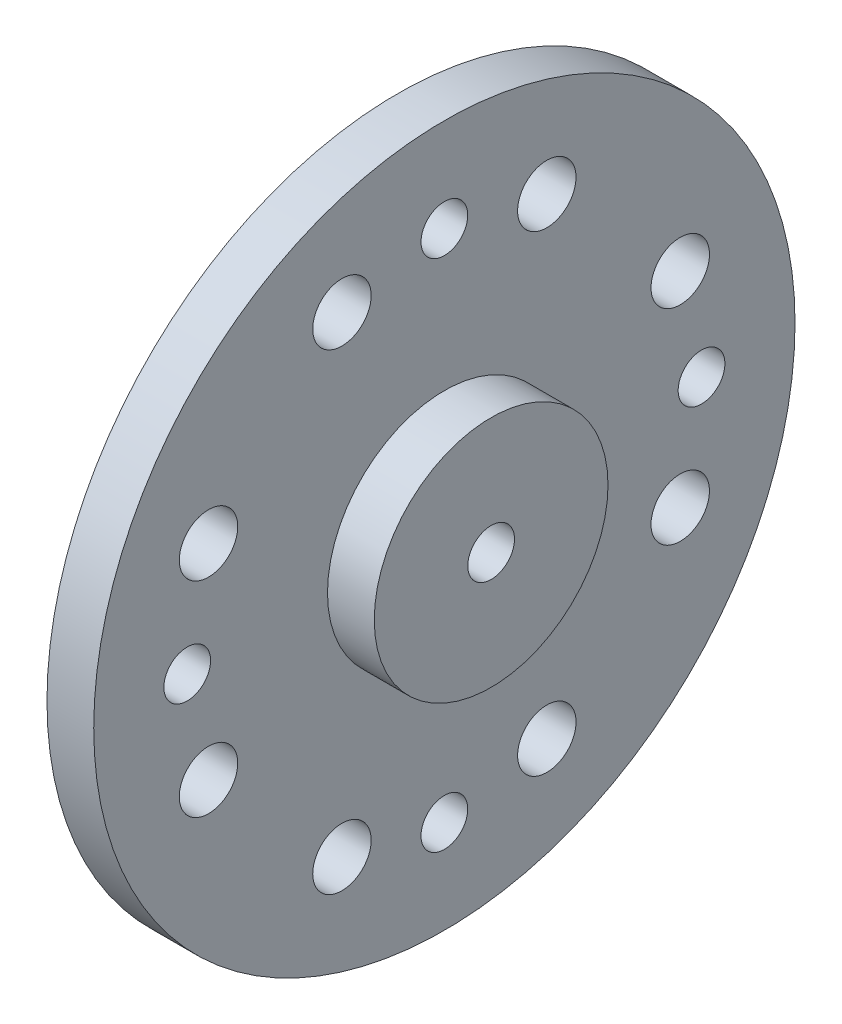
ISO-10303-21;
HEADER;
FILE_DESCRIPTION(('STEP AP214'),'2;1');
FILE_NAME('part.step','',(''),(''),'','','');
FILE_SCHEMA(('AUTOMOTIVE_DESIGN { 1 0 10303 214 1 1 1 1 }'));
ENDSEC;
DATA;
#1=APPLICATION_CONTEXT('core data for automotive mechanical design processes');
#2=APPLICATION_PROTOCOL_DEFINITION('international standard','automotive_design',2000,#1);
#3=PRODUCT_CONTEXT('',#1,'mechanical');
#4=PRODUCT('Part','Part','',(#3));
#5=PRODUCT_RELATED_PRODUCT_CATEGORY('part','',(#4));
#6=PRODUCT_DEFINITION_FORMATION('','',#4);
#7=PRODUCT_DEFINITION_CONTEXT('part definition',#1,'design');
#8=PRODUCT_DEFINITION('design','',#6,#7);
#9=PRODUCT_DEFINITION_SHAPE('','',#8);
#10=(LENGTH_UNIT() NAMED_UNIT(*) SI_UNIT(.MILLI.,.METRE.));
#11=(NAMED_UNIT(*) PLANE_ANGLE_UNIT() SI_UNIT($,.RADIAN.));
#12=(NAMED_UNIT(*) SI_UNIT($,.STERADIAN.) SOLID_ANGLE_UNIT());
#13=UNCERTAINTY_MEASURE_WITH_UNIT(LENGTH_MEASURE(1.E-05),#10,'distance_accuracy_value','');
#14=(GEOMETRIC_REPRESENTATION_CONTEXT(3) GLOBAL_UNCERTAINTY_ASSIGNED_CONTEXT((#13)) GLOBAL_UNIT_ASSIGNED_CONTEXT((#10,
#11,#12)) REPRESENTATION_CONTEXT('',''));
#15=CARTESIAN_POINT('',(0.,0.,0.));
#16=DIRECTION('',(0.,0.,1.));
#17=DIRECTION('',(1.,0.,0.));
#18=AXIS2_PLACEMENT_3D('',#15,#16,#17);
#19=CARTESIAN_POINT('',(0.,0.,0.));
#20=DIRECTION('',(-1.,0.,0.));
#21=DIRECTION('',(0.,0.,1.));
#22=AXIS2_PLACEMENT_3D('',#19,#20,#21);
#23=CYLINDRICAL_SURFACE('',#22,15.);
#24=CARTESIAN_POINT('',(3.,0.,0.));
#25=DIRECTION('',(-1.,0.,0.));
#26=DIRECTION('',(0.,0.,1.));
#27=AXIS2_PLACEMENT_3D('',#24,#25,#26);
#28=CIRCLE('',#27,15.);
#29=CARTESIAN_POINT('',(3.,0.,15.));
#30=VERTEX_POINT('',#29);
#31=EDGE_CURVE('E39',#30,#30,#28,.T.);
#32=ORIENTED_EDGE('',*,*,#31,.T.);
#33=EDGE_LOOP('',(#32));
#34=FACE_BOUND('',#33,.T.);
#35=CARTESIAN_POINT('',(1.,0.,0.));
#36=DIRECTION('',(-1.,0.,0.));
#37=DIRECTION('',(0.,0.,1.));
#38=AXIS2_PLACEMENT_3D('',#35,#36,#37);
#39=CIRCLE('',#38,15.);
#40=CARTESIAN_POINT('',(1.,0.,15.));
#41=VERTEX_POINT('',#40);
#42=EDGE_CURVE('E129',#41,#41,#39,.T.);
#43=ORIENTED_EDGE('',*,*,#42,.F.);
#44=EDGE_LOOP('',(#43));
#45=FACE_BOUND('',#44,.T.);
#46=ADVANCED_FACE('F31',(#34,#45),#23,.T.);
#47=CARTESIAN_POINT('',(0.,15.,0.));
#48=DIRECTION('',(1.,0.,0.));
#49=DIRECTION('',(0.,0.,-1.));
#50=AXIS2_PLACEMENT_3D('',#47,#48,#49);
#51=PLANE('',#50);
#52=CARTESIAN_POINT('',(0.,0.,0.));
#53=DIRECTION('',(1.,0.,0.));
#54=DIRECTION('',(0.,0.,-1.));
#55=AXIS2_PLACEMENT_3D('',#52,#53,#54);
#56=CIRCLE('',#55,1.5);
#57=CARTESIAN_POINT('',(0.,0.,-1.5));
#58=VERTEX_POINT('',#57);
#59=EDGE_CURVE('E43',#58,#58,#56,.T.);
#60=ORIENTED_EDGE('',*,*,#59,.T.);
#61=EDGE_LOOP('',(#60));
#62=FACE_BOUND('',#61,.T.);
#63=CARTESIAN_POINT('',(0.,0.,0.));
#64=DIRECTION('',(-1.,0.,0.));
#65=DIRECTION('',(0.,0.,1.));
#66=AXIS2_PLACEMENT_3D('',#63,#64,#65);
#67=CIRCLE('',#66,5.);
#68=CARTESIAN_POINT('',(0.,0.,5.));
#69=VERTEX_POINT('',#68);
#70=EDGE_CURVE('E133',#69,#69,#67,.T.);
#71=ORIENTED_EDGE('',*,*,#70,.T.);
#72=EDGE_LOOP('',(#71));
#73=FACE_BOUND('',#72,.T.);
#74=ADVANCED_FACE('F165',(#62,#73),#51,.F.);
#75=CARTESIAN_POINT('',(0.,11.,0.));
#76=DIRECTION('',(1.,0.,0.));
#77=DIRECTION('',(0.,0.,-1.));
#78=AXIS2_PLACEMENT_3D('',#75,#76,#77);
#79=CYLINDRICAL_SURFACE('',#78,1.);
#80=CARTESIAN_POINT('',(3.,11.,0.));
#81=DIRECTION('',(1.,0.,0.));
#82=DIRECTION('',(0.,0.,-1.));
#83=AXIS2_PLACEMENT_3D('',#80,#81,#82);
#84=CIRCLE('',#83,1.);
#85=CARTESIAN_POINT('',(3.,11.,-1.));
#86=VERTEX_POINT('',#85);
#87=EDGE_CURVE('E48',#86,#86,#84,.T.);
#88=ORIENTED_EDGE('',*,*,#87,.T.);
#89=EDGE_LOOP('',(#88));
#90=FACE_BOUND('',#89,.T.);
#91=CARTESIAN_POINT('',(1.,11.,0.));
#92=DIRECTION('',(-1.,0.,0.));
#93=DIRECTION('',(0.,0.,1.));
#94=AXIS2_PLACEMENT_3D('',#91,#92,#93);
#95=CIRCLE('',#94,1.);
#96=CARTESIAN_POINT('',(1.,11.,1.));
#97=VERTEX_POINT('',#96);
#98=EDGE_CURVE('E94',#97,#97,#95,.F.);
#99=ORIENTED_EDGE('',*,*,#98,.F.);
#100=EDGE_LOOP('',(#99));
#101=FACE_BOUND('',#100,.T.);
#102=ADVANCED_FACE('F162',(#90,#101),#79,.F.);
#103=CARTESIAN_POINT('',(0.,10.089572098093,4.38184149386807));
#104=DIRECTION('',(1.,0.,0.));
#105=DIRECTION('',(0.,0.,-1.));
#106=AXIS2_PLACEMENT_3D('',#103,#104,#105);
#107=CYLINDRICAL_SURFACE('',#106,1.25);
#108=CARTESIAN_POINT('',(3.,10.089572098093,4.38184149386807));
#109=DIRECTION('',(1.,0.,0.));
#110=DIRECTION('',(0.,0.,-1.));
#111=AXIS2_PLACEMENT_3D('',#108,#109,#110);
#112=CIRCLE('',#111,1.25);
#113=CARTESIAN_POINT('',(3.,10.089572098093,3.13184149386807));
#114=VERTEX_POINT('',#113);
#115=EDGE_CURVE('E51',#114,#114,#112,.T.);
#116=ORIENTED_EDGE('',*,*,#115,.T.);
#117=EDGE_LOOP('',(#116));
#118=FACE_BOUND('',#117,.T.);
#119=CARTESIAN_POINT('',(1.,10.089572098093,4.38184149386807));
#120=DIRECTION('',(-1.,0.,0.));
#121=DIRECTION('',(0.,0.,1.));
#122=AXIS2_PLACEMENT_3D('',#119,#120,#121);
#123=CIRCLE('',#122,1.25);
#124=CARTESIAN_POINT('',(1.,10.089572098093,5.63184149386807));
#125=VERTEX_POINT('',#124);
#126=EDGE_CURVE('E99',#125,#125,#123,.F.);
#127=ORIENTED_EDGE('',*,*,#126,.F.);
#128=EDGE_LOOP('',(#127));
#129=FACE_BOUND('',#128,.T.);
#130=ADVANCED_FACE('F164',(#118,#129),#107,.F.);
#131=CARTESIAN_POINT('',(0.,10.0895720980929,-4.38184149386807));
#132=DIRECTION('',(1.,0.,0.));
#133=DIRECTION('',(0.,0.,-1.));
#134=AXIS2_PLACEMENT_3D('',#131,#132,#133);
#135=CYLINDRICAL_SURFACE('',#134,1.25);
#136=CARTESIAN_POINT('',(3.,10.0895720980929,-4.38184149386807));
#137=DIRECTION('',(1.,0.,0.));
#138=DIRECTION('',(0.,0.,1.));
#139=AXIS2_PLACEMENT_3D('',#136,#137,#138);
#140=CIRCLE('',#139,1.25);
#141=CARTESIAN_POINT('',(3.,10.0895720980929,-3.13184149386807));
#142=VERTEX_POINT('',#141);
#143=EDGE_CURVE('E54',#142,#142,#140,.T.);
#144=ORIENTED_EDGE('',*,*,#143,.T.);
#145=EDGE_LOOP('',(#144));
#146=FACE_BOUND('',#145,.T.);
#147=CARTESIAN_POINT('',(1.,10.0895720980929,-4.38184149386807));
#148=DIRECTION('',(-1.,0.,0.));
#149=DIRECTION('',(0.,0.,1.));
#150=AXIS2_PLACEMENT_3D('',#147,#148,#149);
#151=CIRCLE('',#150,1.25);
#152=CARTESIAN_POINT('',(1.,10.0895720980929,-3.13184149386807));
#153=VERTEX_POINT('',#152);
#154=EDGE_CURVE('E102',#153,#153,#151,.F.);
#155=ORIENTED_EDGE('',*,*,#154,.F.);
#156=EDGE_LOOP('',(#155));
#157=FACE_BOUND('',#156,.T.);
#158=ADVANCED_FACE('F172',(#146,#157),#135,.F.);
#159=CARTESIAN_POINT('',(0.,0.,-11.));
#160=DIRECTION('',(1.,0.,0.));
#161=DIRECTION('',(0.,0.,-1.));
#162=AXIS2_PLACEMENT_3D('',#159,#160,#161);
#163=CYLINDRICAL_SURFACE('',#162,1.);
#164=CARTESIAN_POINT('',(3.,0.,-11.));
#165=DIRECTION('',(1.,0.,0.));
#166=DIRECTION('',(0.,0.,-1.));
#167=AXIS2_PLACEMENT_3D('',#164,#165,#166);
#168=CIRCLE('',#167,1.);
#169=CARTESIAN_POINT('',(3.,0.,-12.));
#170=VERTEX_POINT('',#169);
#171=EDGE_CURVE('E57',#170,#170,#168,.T.);
#172=ORIENTED_EDGE('',*,*,#171,.T.);
#173=EDGE_LOOP('',(#172));
#174=FACE_BOUND('',#173,.T.);
#175=CARTESIAN_POINT('',(1.,0.,-11.));
#176=DIRECTION('',(-1.,0.,0.));
#177=DIRECTION('',(0.,0.,1.));
#178=AXIS2_PLACEMENT_3D('',#175,#176,#177);
#179=CIRCLE('',#178,1.);
#180=CARTESIAN_POINT('',(1.,0.,-10.));
#181=VERTEX_POINT('',#180);
#182=EDGE_CURVE('E105',#181,#181,#179,.F.);
#183=ORIENTED_EDGE('',*,*,#182,.F.);
#184=EDGE_LOOP('',(#183));
#185=FACE_BOUND('',#184,.T.);
#186=ADVANCED_FACE('F247',(#174,#185),#163,.F.);
#187=CARTESIAN_POINT('',(0.,4.38184149386803,-10.089572098093));
#188=DIRECTION('',(1.,0.,0.));
#189=DIRECTION('',(0.,0.,-1.));
#190=AXIS2_PLACEMENT_3D('',#187,#188,#189);
#191=CYLINDRICAL_SURFACE('',#190,1.25);
#192=CARTESIAN_POINT('',(3.,4.38184149386803,-10.089572098093));
#193=DIRECTION('',(1.,0.,0.));
#194=DIRECTION('',(0.,0.,-1.));
#195=AXIS2_PLACEMENT_3D('',#192,#193,#194);
#196=CIRCLE('',#195,1.25);
#197=CARTESIAN_POINT('',(3.,4.38184149386803,-11.339572098093));
#198=VERTEX_POINT('',#197);
#199=EDGE_CURVE('E60',#198,#198,#196,.T.);
#200=ORIENTED_EDGE('',*,*,#199,.T.);
#201=EDGE_LOOP('',(#200));
#202=FACE_BOUND('',#201,.T.);
#203=CARTESIAN_POINT('',(1.,4.38184149386803,-10.089572098093));
#204=DIRECTION('',(-1.,0.,0.));
#205=DIRECTION('',(0.,0.,1.));
#206=AXIS2_PLACEMENT_3D('',#203,#204,#205);
#207=CIRCLE('',#206,1.25);
#208=CARTESIAN_POINT('',(1.,4.38184149386803,-8.83957209809298));
#209=VERTEX_POINT('',#208);
#210=EDGE_CURVE('E108',#209,#209,#207,.F.);
#211=ORIENTED_EDGE('',*,*,#210,.F.);
#212=EDGE_LOOP('',(#211));
#213=FACE_BOUND('',#212,.T.);
#214=ADVANCED_FACE('F243',(#202,#213),#191,.F.);
#215=CARTESIAN_POINT('',(0.,-4.3818414938681,-10.0895720980929));
#216=DIRECTION('',(1.,0.,0.));
#217=DIRECTION('',(0.,0.,-1.));
#218=AXIS2_PLACEMENT_3D('',#215,#216,#217);
#219=CYLINDRICAL_SURFACE('',#218,1.25);
#220=CARTESIAN_POINT('',(3.,-4.3818414938681,-10.0895720980929));
#221=DIRECTION('',(1.,0.,0.));
#222=DIRECTION('',(0.,0.,1.));
#223=AXIS2_PLACEMENT_3D('',#220,#221,#222);
#224=CIRCLE('',#223,1.25);
#225=CARTESIAN_POINT('',(3.,-4.3818414938681,-8.83957209809292));
#226=VERTEX_POINT('',#225);
#227=EDGE_CURVE('E63',#226,#226,#224,.T.);
#228=ORIENTED_EDGE('',*,*,#227,.T.);
#229=EDGE_LOOP('',(#228));
#230=FACE_BOUND('',#229,.T.);
#231=CARTESIAN_POINT('',(1.,-4.3818414938681,-10.0895720980929));
#232=DIRECTION('',(-1.,0.,0.));
#233=DIRECTION('',(0.,0.,1.));
#234=AXIS2_PLACEMENT_3D('',#231,#232,#233);
#235=CIRCLE('',#234,1.25);
#236=CARTESIAN_POINT('',(1.,-4.3818414938681,-8.83957209809292));
#237=VERTEX_POINT('',#236);
#238=EDGE_CURVE('E111',#237,#237,#235,.F.);
#239=ORIENTED_EDGE('',*,*,#238,.F.);
#240=EDGE_LOOP('',(#239));
#241=FACE_BOUND('',#240,.T.);
#242=ADVANCED_FACE('F239',(#230,#241),#219,.F.);
#243=CARTESIAN_POINT('',(0.,-11.,0.));
#244=DIRECTION('',(1.,0.,0.));
#245=DIRECTION('',(0.,0.,-1.));
#246=AXIS2_PLACEMENT_3D('',#243,#244,#245);
#247=CYLINDRICAL_SURFACE('',#246,1.);
#248=CARTESIAN_POINT('',(3.,-11.,0.));
#249=DIRECTION('',(1.,0.,0.));
#250=DIRECTION('',(0.,0.,-1.));
#251=AXIS2_PLACEMENT_3D('',#248,#249,#250);
#252=CIRCLE('',#251,1.);
#253=CARTESIAN_POINT('',(3.,-11.,-0.999999999999924));
#254=VERTEX_POINT('',#253);
#255=EDGE_CURVE('E66',#254,#254,#252,.T.);
#256=ORIENTED_EDGE('',*,*,#255,.T.);
#257=EDGE_LOOP('',(#256));
#258=FACE_BOUND('',#257,.T.);
#259=CARTESIAN_POINT('',(1.,-11.,0.));
#260=DIRECTION('',(-1.,0.,0.));
#261=DIRECTION('',(0.,0.,1.));
#262=AXIS2_PLACEMENT_3D('',#259,#260,#261);
#263=CIRCLE('',#262,1.);
#264=CARTESIAN_POINT('',(1.,-11.,1.00000000000008));
#265=VERTEX_POINT('',#264);
#266=EDGE_CURVE('E114',#265,#265,#263,.F.);
#267=ORIENTED_EDGE('',*,*,#266,.F.);
#268=EDGE_LOOP('',(#267));
#269=FACE_BOUND('',#268,.T.);
#270=ADVANCED_FACE('F235',(#258,#269),#247,.F.);
#271=CARTESIAN_POINT('',(0.,-10.089572098093,-4.381841493868));
#272=DIRECTION('',(1.,0.,0.));
#273=DIRECTION('',(0.,0.,-1.));
#274=AXIS2_PLACEMENT_3D('',#271,#272,#273);
#275=CYLINDRICAL_SURFACE('',#274,1.25);
#276=CARTESIAN_POINT('',(3.,-10.089572098093,-4.381841493868));
#277=DIRECTION('',(1.,0.,0.));
#278=DIRECTION('',(0.,0.,-1.));
#279=AXIS2_PLACEMENT_3D('',#276,#277,#278);
#280=CIRCLE('',#279,1.25);
#281=CARTESIAN_POINT('',(3.,-10.089572098093,-5.631841493868));
#282=VERTEX_POINT('',#281);
#283=EDGE_CURVE('E69',#282,#282,#280,.T.);
#284=ORIENTED_EDGE('',*,*,#283,.T.);
#285=EDGE_LOOP('',(#284));
#286=FACE_BOUND('',#285,.T.);
#287=CARTESIAN_POINT('',(1.,-10.089572098093,-4.381841493868));
#288=DIRECTION('',(-1.,0.,0.));
#289=DIRECTION('',(0.,0.,1.));
#290=AXIS2_PLACEMENT_3D('',#287,#288,#289);
#291=CIRCLE('',#290,1.25);
#292=CARTESIAN_POINT('',(1.,-10.089572098093,-3.131841493868));
#293=VERTEX_POINT('',#292);
#294=EDGE_CURVE('E117',#293,#293,#291,.F.);
#295=ORIENTED_EDGE('',*,*,#294,.F.);
#296=EDGE_LOOP('',(#295));
#297=FACE_BOUND('',#296,.T.);
#298=ADVANCED_FACE('F231',(#286,#297),#275,.F.);
#299=CARTESIAN_POINT('',(0.,-10.0895720980929,4.38184149386814));
#300=DIRECTION('',(1.,0.,0.));
#301=DIRECTION('',(0.,0.,-1.));
#302=AXIS2_PLACEMENT_3D('',#299,#300,#301);
#303=CYLINDRICAL_SURFACE('',#302,1.25);
#304=CARTESIAN_POINT('',(3.,-10.0895720980929,4.38184149386814));
#305=DIRECTION('',(1.,0.,0.));
#306=DIRECTION('',(0.,0.,1.));
#307=AXIS2_PLACEMENT_3D('',#304,#305,#306);
#308=CIRCLE('',#307,1.25);
#309=CARTESIAN_POINT('',(3.,-10.0895720980929,5.63184149386814));
#310=VERTEX_POINT('',#309);
#311=EDGE_CURVE('E72',#310,#310,#308,.T.);
#312=ORIENTED_EDGE('',*,*,#311,.T.);
#313=EDGE_LOOP('',(#312));
#314=FACE_BOUND('',#313,.T.);
#315=CARTESIAN_POINT('',(1.,-10.0895720980929,4.38184149386814));
#316=DIRECTION('',(-1.,0.,0.));
#317=DIRECTION('',(0.,0.,1.));
#318=AXIS2_PLACEMENT_3D('',#315,#316,#317);
#319=CIRCLE('',#318,1.25);
#320=CARTESIAN_POINT('',(1.,-10.0895720980929,5.63184149386814));
#321=VERTEX_POINT('',#320);
#322=EDGE_CURVE('E120',#321,#321,#319,.F.);
#323=ORIENTED_EDGE('',*,*,#322,.F.);
#324=EDGE_LOOP('',(#323));
#325=FACE_BOUND('',#324,.T.);
#326=ADVANCED_FACE('F227',(#314,#325),#303,.F.);
#327=CARTESIAN_POINT('',(0.,1.1521895091661E-13,11.));
#328=DIRECTION('',(1.,0.,0.));
#329=DIRECTION('',(0.,0.,-1.));
#330=AXIS2_PLACEMENT_3D('',#327,#328,#329);
#331=CYLINDRICAL_SURFACE('',#330,1.);
#332=CARTESIAN_POINT('',(3.,1.1521895091661E-13,11.));
#333=DIRECTION('',(1.,0.,0.));
#334=DIRECTION('',(0.,0.,-1.));
#335=AXIS2_PLACEMENT_3D('',#332,#333,#334);
#336=CIRCLE('',#335,1.);
#337=CARTESIAN_POINT('',(3.,1.1521895091661E-13,10.));
#338=VERTEX_POINT('',#337);
#339=EDGE_CURVE('E75',#338,#338,#336,.T.);
#340=ORIENTED_EDGE('',*,*,#339,.T.);
#341=EDGE_LOOP('',(#340));
#342=FACE_BOUND('',#341,.T.);
#343=CARTESIAN_POINT('',(1.,1.1521895091661E-13,11.));
#344=DIRECTION('',(-1.,0.,0.));
#345=DIRECTION('',(0.,0.,1.));
#346=AXIS2_PLACEMENT_3D('',#343,#344,#345);
#347=CIRCLE('',#346,1.);
#348=CARTESIAN_POINT('',(1.,1.1521895091661E-13,12.));
#349=VERTEX_POINT('',#348);
#350=EDGE_CURVE('E123',#349,#349,#347,.F.);
#351=ORIENTED_EDGE('',*,*,#350,.F.);
#352=EDGE_LOOP('',(#351));
#353=FACE_BOUND('',#352,.T.);
#354=ADVANCED_FACE('F223',(#342,#353),#331,.F.);
#355=CARTESIAN_POINT('',(0.,-4.38184149386796,10.089572098093));
#356=DIRECTION('',(1.,0.,0.));
#357=DIRECTION('',(0.,0.,-1.));
#358=AXIS2_PLACEMENT_3D('',#355,#356,#357);
#359=CYLINDRICAL_SURFACE('',#358,1.25);
#360=CARTESIAN_POINT('',(3.,-4.38184149386796,10.089572098093));
#361=DIRECTION('',(1.,0.,0.));
#362=DIRECTION('',(0.,0.,-1.));
#363=AXIS2_PLACEMENT_3D('',#360,#361,#362);
#364=CIRCLE('',#363,1.25);
#365=CARTESIAN_POINT('',(3.,-4.38184149386796,8.83957209809301));
#366=VERTEX_POINT('',#365);
#367=EDGE_CURVE('E78',#366,#366,#364,.T.);
#368=ORIENTED_EDGE('',*,*,#367,.T.);
#369=EDGE_LOOP('',(#368));
#370=FACE_BOUND('',#369,.T.);
#371=CARTESIAN_POINT('',(1.,-4.38184149386796,10.089572098093));
#372=DIRECTION('',(-1.,0.,0.));
#373=DIRECTION('',(0.,0.,1.));
#374=AXIS2_PLACEMENT_3D('',#371,#372,#373);
#375=CIRCLE('',#374,1.25);
#376=CARTESIAN_POINT('',(1.,-4.38184149386796,11.339572098093));
#377=VERTEX_POINT('',#376);
#378=EDGE_CURVE('E126',#377,#377,#375,.F.);
#379=ORIENTED_EDGE('',*,*,#378,.F.);
#380=EDGE_LOOP('',(#379));
#381=FACE_BOUND('',#380,.T.);
#382=ADVANCED_FACE('F219',(#370,#381),#359,.F.);
#383=CARTESIAN_POINT('',(0.,4.38184149386817,10.0895720980929));
#384=DIRECTION('',(1.,0.,0.));
#385=DIRECTION('',(0.,0.,-1.));
#386=AXIS2_PLACEMENT_3D('',#383,#384,#385);
#387=CYLINDRICAL_SURFACE('',#386,1.25);
#388=CARTESIAN_POINT('',(3.,4.38184149386817,10.0895720980929));
#389=DIRECTION('',(1.,0.,0.));
#390=DIRECTION('',(0.,0.,1.));
#391=AXIS2_PLACEMENT_3D('',#388,#389,#390);
#392=CIRCLE('',#391,1.25);
#393=CARTESIAN_POINT('',(3.,4.38184149386817,11.3395720980929));
#394=VERTEX_POINT('',#393);
#395=EDGE_CURVE('E81',#394,#394,#392,.T.);
#396=ORIENTED_EDGE('',*,*,#395,.T.);
#397=EDGE_LOOP('',(#396));
#398=FACE_BOUND('',#397,.T.);
#399=CARTESIAN_POINT('',(1.,4.38184149386817,10.0895720980929));
#400=DIRECTION('',(-1.,0.,0.));
#401=DIRECTION('',(0.,0.,1.));
#402=AXIS2_PLACEMENT_3D('',#399,#400,#401);
#403=CIRCLE('',#402,1.25);
#404=CARTESIAN_POINT('',(1.,4.38184149386817,11.3395720980929));
#405=VERTEX_POINT('',#404);
#406=EDGE_CURVE('E35',#405,#405,#403,.F.);
#407=ORIENTED_EDGE('',*,*,#406,.F.);
#408=EDGE_LOOP('',(#407));
#409=FACE_BOUND('',#408,.T.);
#410=ADVANCED_FACE('F194',(#398,#409),#387,.F.);
#411=CARTESIAN_POINT('',(3.,14.,0.));
#412=DIRECTION('',(-1.,0.,0.));
#413=DIRECTION('',(0.,0.,1.));
#414=AXIS2_PLACEMENT_3D('',#411,#412,#413);
#415=PLANE('',#414);
#416=ORIENTED_EDGE('',*,*,#31,.F.);
#417=EDGE_LOOP('',(#416));
#418=FACE_BOUND('',#417,.T.);
#419=ORIENTED_EDGE('',*,*,#87,.F.);
#420=EDGE_LOOP('',(#419));
#421=FACE_BOUND('',#420,.T.);
#422=ORIENTED_EDGE('',*,*,#115,.F.);
#423=EDGE_LOOP('',(#422));
#424=FACE_BOUND('',#423,.T.);
#425=ORIENTED_EDGE('',*,*,#143,.F.);
#426=EDGE_LOOP('',(#425));
#427=FACE_BOUND('',#426,.T.);
#428=ORIENTED_EDGE('',*,*,#171,.F.);
#429=EDGE_LOOP('',(#428));
#430=FACE_BOUND('',#429,.T.);
#431=ORIENTED_EDGE('',*,*,#199,.F.);
#432=EDGE_LOOP('',(#431));
#433=FACE_BOUND('',#432,.T.);
#434=ORIENTED_EDGE('',*,*,#227,.F.);
#435=EDGE_LOOP('',(#434));
#436=FACE_BOUND('',#435,.T.);
#437=ORIENTED_EDGE('',*,*,#255,.F.);
#438=EDGE_LOOP('',(#437));
#439=FACE_BOUND('',#438,.T.);
#440=ORIENTED_EDGE('',*,*,#283,.F.);
#441=EDGE_LOOP('',(#440));
#442=FACE_BOUND('',#441,.T.);
#443=ORIENTED_EDGE('',*,*,#311,.F.);
#444=EDGE_LOOP('',(#443));
#445=FACE_BOUND('',#444,.T.);
#446=ORIENTED_EDGE('',*,*,#339,.F.);
#447=EDGE_LOOP('',(#446));
#448=FACE_BOUND('',#447,.T.);
#449=ORIENTED_EDGE('',*,*,#367,.F.);
#450=EDGE_LOOP('',(#449));
#451=FACE_BOUND('',#450,.T.);
#452=ORIENTED_EDGE('',*,*,#395,.F.);
#453=EDGE_LOOP('',(#452));
#454=FACE_BOUND('',#453,.T.);
#455=CARTESIAN_POINT('',(3.,0.,0.));
#456=DIRECTION('',(-1.,0.,0.));
#457=DIRECTION('',(0.,0.,1.));
#458=AXIS2_PLACEMENT_3D('',#455,#456,#457);
#459=CIRCLE('',#458,5.);
#460=CARTESIAN_POINT('',(3.,0.,5.));
#461=VERTEX_POINT('',#460);
#462=EDGE_CURVE('E10',#461,#461,#459,.F.);
#463=ORIENTED_EDGE('',*,*,#462,.F.);
#464=EDGE_LOOP('',(#463));
#465=FACE_BOUND('',#464,.T.);
#466=ADVANCED_FACE('F33',(#418,#421,#424,#427,#430,#433,#436,#439,#442,#445,#448,#451,#454,
#465),#415,.F.);
#467=CARTESIAN_POINT('',(0.,0.,0.));
#468=DIRECTION('',(1.,0.,0.));
#469=DIRECTION('',(0.,0.,-1.));
#470=AXIS2_PLACEMENT_3D('',#467,#468,#469);
#471=CYLINDRICAL_SURFACE('',#470,1.5);
#472=ORIENTED_EDGE('',*,*,#59,.F.);
#473=EDGE_LOOP('',(#472));
#474=FACE_BOUND('',#473,.T.);
#475=CARTESIAN_POINT('',(3.,0.,0.));
#476=DIRECTION('',(1.,0.,0.));
#477=DIRECTION('',(0.,0.,-1.));
#478=AXIS2_PLACEMENT_3D('',#475,#476,#477);
#479=CIRCLE('',#478,1.5);
#480=CARTESIAN_POINT('',(3.,0.,-1.5));
#481=VERTEX_POINT('',#480);
#482=EDGE_CURVE('E84',#481,#481,#479,.F.);
#483=ORIENTED_EDGE('',*,*,#482,.F.);
#484=EDGE_LOOP('',(#483));
#485=FACE_BOUND('',#484,.T.);
#486=ADVANCED_FACE('F183',(#474,#485),#471,.F.);
#487=CARTESIAN_POINT('',(3.,0.,0.));
#488=DIRECTION('',(1.,0.,0.));
#489=DIRECTION('',(0.,0.,-1.));
#490=AXIS2_PLACEMENT_3D('',#487,#488,#489);
#491=PLANE('',#490);
#492=CARTESIAN_POINT('',(3.,0.,0.));
#493=DIRECTION('',(1.,0.,0.));
#494=DIRECTION('',(0.,0.,-1.));
#495=AXIS2_PLACEMENT_3D('',#492,#493,#494);
#496=CIRCLE('',#495,1.);
#497=CARTESIAN_POINT('',(3.,0.,-1.));
#498=VERTEX_POINT('',#497);
#499=EDGE_CURVE('E91',#498,#498,#496,.T.);
#500=ORIENTED_EDGE('',*,*,#499,.T.);
#501=EDGE_LOOP('',(#500));
#502=FACE_BOUND('',#501,.T.);
#503=ORIENTED_EDGE('',*,*,#482,.T.);
#504=EDGE_LOOP('',(#503));
#505=FACE_BOUND('',#504,.T.);
#506=ADVANCED_FACE('F185',(#502,#505),#491,.F.);
#507=CARTESIAN_POINT('',(5.,0.,0.));
#508=DIRECTION('',(1.,0.,0.));
#509=DIRECTION('',(0.,0.,-1.));
#510=AXIS2_PLACEMENT_3D('',#507,#508,#509);
#511=PLANE('',#510);
#512=CARTESIAN_POINT('',(5.,0.,0.));
#513=DIRECTION('',(1.,0.,0.));
#514=DIRECTION('',(0.,0.,-1.));
#515=AXIS2_PLACEMENT_3D('',#512,#513,#514);
#516=CIRCLE('',#515,5.);
#517=CARTESIAN_POINT('',(5.,0.,-5.));
#518=VERTEX_POINT('',#517);
#519=EDGE_CURVE('E87',#518,#518,#516,.T.);
#520=ORIENTED_EDGE('',*,*,#519,.T.);
#521=EDGE_LOOP('',(#520));
#522=FACE_BOUND('',#521,.T.);
#523=CARTESIAN_POINT('',(5.,0.,0.));
#524=DIRECTION('',(1.,0.,0.));
#525=DIRECTION('',(0.,0.,-1.));
#526=AXIS2_PLACEMENT_3D('',#523,#524,#525);
#527=CIRCLE('',#526,1.);
#528=CARTESIAN_POINT('',(5.,0.,-1.));
#529=VERTEX_POINT('',#528);
#530=EDGE_CURVE('E90',#529,#529,#527,.T.);
#531=ORIENTED_EDGE('',*,*,#530,.F.);
#532=EDGE_LOOP('',(#531));
#533=FACE_BOUND('',#532,.T.);
#534=ADVANCED_FACE('F191',(#522,#533),#511,.T.);
#535=CARTESIAN_POINT('',(5.,0.,0.));
#536=DIRECTION('',(-1.,0.,0.));
#537=DIRECTION('',(0.,0.,1.));
#538=AXIS2_PLACEMENT_3D('',#535,#536,#537);
#539=CYLINDRICAL_SURFACE('',#538,5.);
#540=ORIENTED_EDGE('',*,*,#519,.F.);
#541=EDGE_LOOP('',(#540));
#542=FACE_BOUND('',#541,.T.);
#543=ORIENTED_EDGE('',*,*,#462,.T.);
#544=EDGE_LOOP('',(#543));
#545=FACE_BOUND('',#544,.T.);
#546=ADVANCED_FACE('F209',(#542,#545),#539,.T.);
#547=CARTESIAN_POINT('',(5.,0.,0.));
#548=DIRECTION('',(-1.,0.,0.));
#549=DIRECTION('',(0.,0.,1.));
#550=AXIS2_PLACEMENT_3D('',#547,#548,#549);
#551=CYLINDRICAL_SURFACE('',#550,1.);
#552=ORIENTED_EDGE('',*,*,#530,.T.);
#553=EDGE_LOOP('',(#552));
#554=FACE_BOUND('',#553,.T.);
#555=ORIENTED_EDGE('',*,*,#499,.F.);
#556=EDGE_LOOP('',(#555));
#557=FACE_BOUND('',#556,.T.);
#558=ADVANCED_FACE('F145',(#554,#557),#551,.F.);
#559=CARTESIAN_POINT('',(1.,0.,0.));
#560=DIRECTION('',(-1.,0.,0.));
#561=DIRECTION('',(0.,0.,1.));
#562=AXIS2_PLACEMENT_3D('',#559,#560,#561);
#563=PLANE('',#562);
#564=ORIENTED_EDGE('',*,*,#126,.T.);
#565=EDGE_LOOP('',(#564));
#566=FACE_BOUND('',#565,.T.);
#567=ORIENTED_EDGE('',*,*,#182,.T.);
#568=EDGE_LOOP('',(#567));
#569=FACE_BOUND('',#568,.T.);
#570=ORIENTED_EDGE('',*,*,#238,.T.);
#571=EDGE_LOOP('',(#570));
#572=FACE_BOUND('',#571,.T.);
#573=ORIENTED_EDGE('',*,*,#294,.T.);
#574=EDGE_LOOP('',(#573));
#575=FACE_BOUND('',#574,.T.);
#576=ORIENTED_EDGE('',*,*,#350,.T.);
#577=EDGE_LOOP('',(#576));
#578=FACE_BOUND('',#577,.T.);
#579=ORIENTED_EDGE('',*,*,#406,.T.);
#580=EDGE_LOOP('',(#579));
#581=FACE_BOUND('',#580,.T.);
#582=CARTESIAN_POINT('',(1.,0.,0.));
#583=DIRECTION('',(-1.,0.,0.));
#584=DIRECTION('',(0.,0.,1.));
#585=AXIS2_PLACEMENT_3D('',#582,#583,#584);
#586=CIRCLE('',#585,5.);
#587=CARTESIAN_POINT('',(1.,0.,5.));
#588=VERTEX_POINT('',#587);
#589=EDGE_CURVE('E132',#588,#588,#586,.T.);
#590=ORIENTED_EDGE('',*,*,#589,.F.);
#591=EDGE_LOOP('',(#590));
#592=FACE_BOUND('',#591,.T.);
#593=ORIENTED_EDGE('',*,*,#42,.T.);
#594=EDGE_LOOP('',(#593));
#595=FACE_BOUND('',#594,.T.);
#596=ORIENTED_EDGE('',*,*,#378,.T.);
#597=EDGE_LOOP('',(#596));
#598=FACE_BOUND('',#597,.T.);
#599=ORIENTED_EDGE('',*,*,#322,.T.);
#600=EDGE_LOOP('',(#599));
#601=FACE_BOUND('',#600,.T.);
#602=ORIENTED_EDGE('',*,*,#266,.T.);
#603=EDGE_LOOP('',(#602));
#604=FACE_BOUND('',#603,.T.);
#605=ORIENTED_EDGE('',*,*,#210,.T.);
#606=EDGE_LOOP('',(#605));
#607=FACE_BOUND('',#606,.T.);
#608=ORIENTED_EDGE('',*,*,#154,.T.);
#609=EDGE_LOOP('',(#608));
#610=FACE_BOUND('',#609,.T.);
#611=ORIENTED_EDGE('',*,*,#98,.T.);
#612=EDGE_LOOP('',(#611));
#613=FACE_BOUND('',#612,.T.);
#614=ADVANCED_FACE('F142',(#566,#569,#572,#575,#578,#581,#592,#595,#598,#601,#604,#607,#610,
#613),#563,.T.);
#615=CARTESIAN_POINT('',(1.,0.,0.));
#616=DIRECTION('',(-1.,0.,0.));
#617=DIRECTION('',(0.,0.,1.));
#618=AXIS2_PLACEMENT_3D('',#615,#616,#617);
#619=CYLINDRICAL_SURFACE('',#618,5.);
#620=ORIENTED_EDGE('',*,*,#589,.T.);
#621=EDGE_LOOP('',(#620));
#622=FACE_BOUND('',#621,.T.);
#623=ORIENTED_EDGE('',*,*,#70,.F.);
#624=EDGE_LOOP('',(#623));
#625=FACE_BOUND('',#624,.T.);
#626=ADVANCED_FACE('F139',(#622,#625),#619,.T.);
#627=CLOSED_SHELL('',(#46,#74,#102,#130,#158,#186,#214,#242,#270,#298,#326,#354,#382,#410,#466,
#486,#506,#534,#546,#558,#614,#626));
#628=MANIFOLD_SOLID_BREP('B2',#627);
#629=ADVANCED_BREP_SHAPE_REPRESENTATION('',(#18,#628),#14);
#630=SHAPE_DEFINITION_REPRESENTATION(#9,#629);
ENDSEC;
END-ISO-10303-21;
